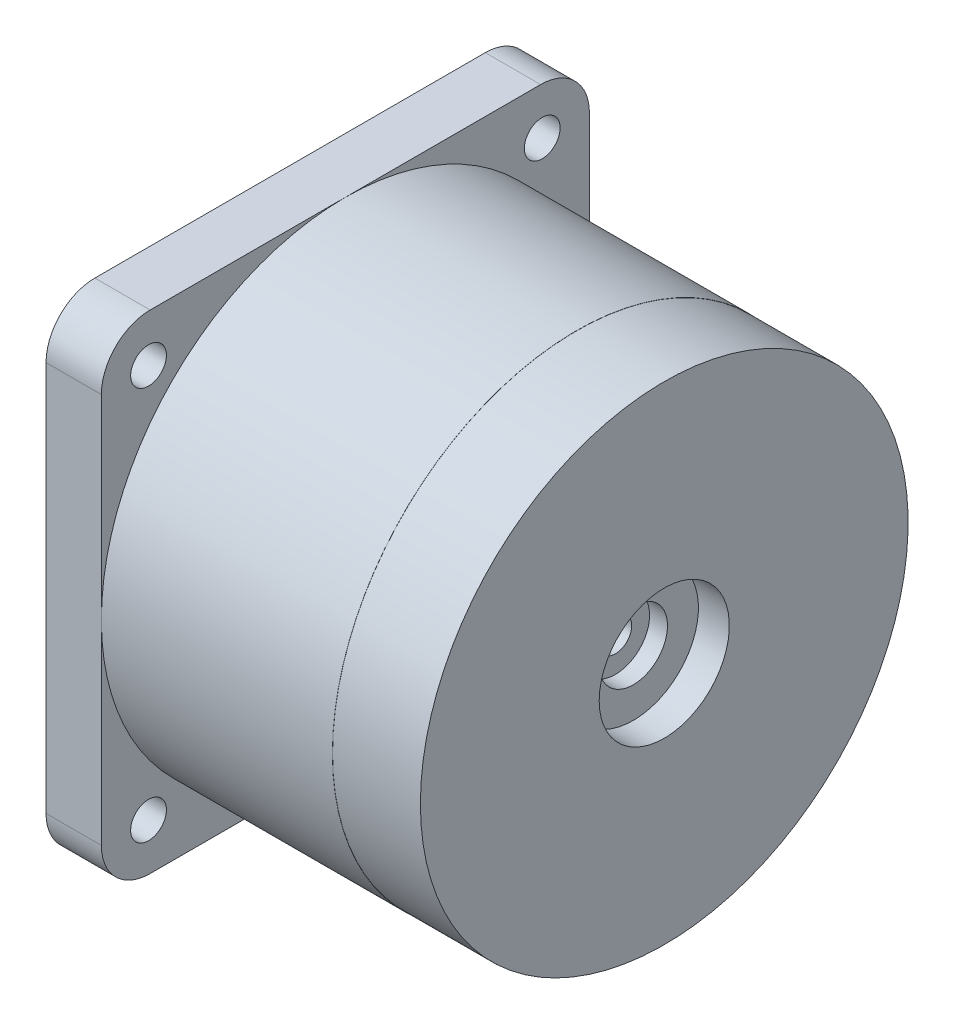
ISO-10303-21;
HEADER;
FILE_DESCRIPTION(('STEP AP214'),'2;1');
FILE_NAME('part.step','',(''),(''),'','','');
FILE_SCHEMA(('AUTOMOTIVE_DESIGN { 1 0 10303 214 1 1 1 1 }'));
ENDSEC;
DATA;
#1=APPLICATION_CONTEXT('core data for automotive mechanical design processes');
#2=APPLICATION_PROTOCOL_DEFINITION('international standard','automotive_design',2000,#1);
#3=PRODUCT_CONTEXT('',#1,'mechanical');
#4=PRODUCT('Part','Part','',(#3));
#5=PRODUCT_RELATED_PRODUCT_CATEGORY('part','',(#4));
#6=PRODUCT_DEFINITION_FORMATION('','',#4);
#7=PRODUCT_DEFINITION_CONTEXT('part definition',#1,'design');
#8=PRODUCT_DEFINITION('design','',#6,#7);
#9=PRODUCT_DEFINITION_SHAPE('','',#8);
#10=(LENGTH_UNIT() NAMED_UNIT(*) SI_UNIT(.MILLI.,.METRE.));
#11=(NAMED_UNIT(*) PLANE_ANGLE_UNIT() SI_UNIT($,.RADIAN.));
#12=(NAMED_UNIT(*) SI_UNIT($,.STERADIAN.) SOLID_ANGLE_UNIT());
#13=UNCERTAINTY_MEASURE_WITH_UNIT(LENGTH_MEASURE(1.E-05),#10,'distance_accuracy_value','');
#14=(GEOMETRIC_REPRESENTATION_CONTEXT(3) GLOBAL_UNCERTAINTY_ASSIGNED_CONTEXT((#13)) GLOBAL_UNIT_ASSIGNED_CONTEXT((#10,
#11,#12)) REPRESENTATION_CONTEXT('',''));
#15=CARTESIAN_POINT('',(0.,0.,0.));
#16=DIRECTION('',(0.,0.,1.));
#17=DIRECTION('',(1.,0.,0.));
#18=AXIS2_PLACEMENT_3D('',#15,#16,#17);
#19=CARTESIAN_POINT('',(0.,0.,0.));
#20=DIRECTION('',(-1.,0.,0.));
#21=DIRECTION('',(0.,0.,1.));
#22=AXIS2_PLACEMENT_3D('',#19,#20,#21);
#23=PLANE('',#22);
#24=CARTESIAN_POINT('',(0.,0.,0.));
#25=DIRECTION('',(-1.,0.,0.));
#26=DIRECTION('',(0.,0.,1.));
#27=AXIS2_PLACEMENT_3D('',#24,#25,#26);
#28=CIRCLE('',#27,14.99);
#29=CARTESIAN_POINT('',(0.,0.,14.99));
#30=VERTEX_POINT('',#29);
#31=EDGE_CURVE('E168',#30,#30,#28,.T.);
#32=ORIENTED_EDGE('',*,*,#31,.F.);
#33=EDGE_LOOP('',(#32));
#34=FACE_BOUND('',#33,.T.);
#35=CARTESIAN_POINT('',(0.,0.,0.));
#36=DIRECTION('',(-1.,0.,0.));
#37=DIRECTION('',(0.,0.,1.));
#38=AXIS2_PLACEMENT_3D('',#35,#36,#37);
#39=CIRCLE('',#38,4.);
#40=CARTESIAN_POINT('',(0.,0.,4.));
#41=VERTEX_POINT('',#40);
#42=EDGE_CURVE('E260',#41,#41,#39,.T.);
#43=ORIENTED_EDGE('',*,*,#42,.T.);
#44=EDGE_LOOP('',(#43));
#45=FACE_BOUND('',#44,.T.);
#46=ADVANCED_FACE('F31',(#34,#45),#23,.F.);
#47=CARTESIAN_POINT('',(-21.4,0.,0.));
#48=DIRECTION('',(-1.,0.,0.));
#49=DIRECTION('',(0.,0.,1.));
#50=AXIS2_PLACEMENT_3D('',#47,#48,#49);
#51=PLANE('',#50);
#52=CARTESIAN_POINT('',(-21.4,0.,0.));
#53=DIRECTION('',(-1.,0.,0.));
#54=DIRECTION('',(0.,0.,1.));
#55=AXIS2_PLACEMENT_3D('',#52,#53,#54);
#56=CIRCLE('',#55,13.5);
#57=CARTESIAN_POINT('',(-21.4,0.,13.5));
#58=VERTEX_POINT('',#57);
#59=EDGE_CURVE('E248',#58,#58,#56,.T.);
#60=ORIENTED_EDGE('',*,*,#59,.T.);
#61=EDGE_LOOP('',(#60));
#62=FACE_BOUND('',#61,.T.);
#63=CARTESIAN_POINT('',(-21.4,-4.9,0.));
#64=DIRECTION('',(-1.,0.,0.));
#65=DIRECTION('',(0.,0.,1.));
#66=AXIS2_PLACEMENT_3D('',#63,#64,#65);
#67=CIRCLE('',#66,5.);
#68=CARTESIAN_POINT('',(-21.4,-4.9,5.));
#69=VERTEX_POINT('',#68);
#70=EDGE_CURVE('E257',#69,#69,#67,.T.);
#71=ORIENTED_EDGE('',*,*,#70,.F.);
#72=EDGE_LOOP('',(#71));
#73=FACE_BOUND('',#72,.T.);
#74=ADVANCED_FACE('F291',(#62,#73),#51,.T.);
#75=CARTESIAN_POINT('',(0.,0.,0.));
#76=DIRECTION('',(-1.,0.,0.));
#77=DIRECTION('',(0.,0.,1.));
#78=AXIS2_PLACEMENT_3D('',#75,#76,#77);
#79=CYLINDRICAL_SURFACE('',#78,14.99);
#80=CARTESIAN_POINT('',(-5.4,0.,0.));
#81=DIRECTION('',(-1.,0.,0.));
#82=DIRECTION('',(0.,0.,1.));
#83=AXIS2_PLACEMENT_3D('',#80,#81,#82);
#84=CIRCLE('',#83,14.99);
#85=CARTESIAN_POINT('',(-5.4,0.,14.99));
#86=VERTEX_POINT('',#85);
#87=EDGE_CURVE('E165',#86,#86,#84,.T.);
#88=ORIENTED_EDGE('',*,*,#87,.F.);
#89=EDGE_LOOP('',(#88));
#90=FACE_BOUND('',#89,.T.);
#91=ORIENTED_EDGE('',*,*,#31,.T.);
#92=EDGE_LOOP('',(#91));
#93=FACE_BOUND('',#92,.T.);
#94=ADVANCED_FACE('F296',(#90,#93),#79,.T.);
#95=CARTESIAN_POINT('',(-5.4,14.99,0.));
#96=DIRECTION('',(-1.,0.,0.));
#97=DIRECTION('',(0.,0.,1.));
#98=AXIS2_PLACEMENT_3D('',#95,#96,#97);
#99=PLANE('',#98);
#100=CARTESIAN_POINT('',(-5.4,0.,0.));
#101=DIRECTION('',(-1.,0.,0.));
#102=DIRECTION('',(0.,0.,1.));
#103=AXIS2_PLACEMENT_3D('',#100,#101,#102);
#104=CIRCLE('',#103,15.);
#105=CARTESIAN_POINT('',(-5.4,0.,15.));
#106=VERTEX_POINT('',#105);
#107=EDGE_CURVE('E136',#106,#106,#104,.T.);
#108=ORIENTED_EDGE('',*,*,#107,.F.);
#109=EDGE_LOOP('',(#108));
#110=FACE_BOUND('',#109,.T.);
#111=ORIENTED_EDGE('',*,*,#87,.T.);
#112=EDGE_LOOP('',(#111));
#113=FACE_BOUND('',#112,.T.);
#114=ADVANCED_FACE('F372',(#110,#113),#99,.F.);
#115=CARTESIAN_POINT('',(0.,0.,0.));
#116=DIRECTION('',(-1.,0.,0.));
#117=DIRECTION('',(0.,0.,1.));
#118=AXIS2_PLACEMENT_3D('',#115,#116,#117);
#119=CYLINDRICAL_SURFACE('',#118,15.);
#120=CARTESIAN_POINT('',(-19.6,0.,0.));
#121=DIRECTION('',(-1.,0.,0.));
#122=DIRECTION('',(0.,0.,1.));
#123=AXIS2_PLACEMENT_3D('',#120,#121,#122);
#124=CIRCLE('',#123,15.);
#125=CARTESIAN_POINT('',(-19.6,0.,15.));
#126=VERTEX_POINT('',#125);
#127=CARTESIAN_POINT('',(-19.6,15.,0.));
#128=VERTEX_POINT('',#127);
#129=EDGE_CURVE('E125',#126,#128,#124,.T.);
#130=ORIENTED_EDGE('',*,*,#129,.F.);
#131=CARTESIAN_POINT('',(-19.6,-15.,0.));
#132=VERTEX_POINT('',#131);
#133=EDGE_CURVE('E129',#132,#126,#124,.T.);
#134=ORIENTED_EDGE('',*,*,#133,.F.);
#135=CARTESIAN_POINT('',(-19.6,0.,-15.));
#136=VERTEX_POINT('',#135);
#137=EDGE_CURVE('E142',#136,#132,#124,.T.);
#138=ORIENTED_EDGE('',*,*,#137,.F.);
#139=EDGE_CURVE('E132',#128,#136,#124,.T.);
#140=ORIENTED_EDGE('',*,*,#139,.F.);
#141=EDGE_LOOP('',(#130,#134,#138,#140));
#142=FACE_BOUND('',#141,.T.);
#143=ORIENTED_EDGE('',*,*,#107,.T.);
#144=EDGE_LOOP('',(#143));
#145=FACE_BOUND('',#144,.T.);
#146=ADVANCED_FACE('F126',(#142,#145),#119,.T.);
#147=CARTESIAN_POINT('',(-19.6,-15.,-15.));
#148=DIRECTION('',(-1.,0.,0.));
#149=DIRECTION('',(0.,0.,1.));
#150=AXIS2_PLACEMENT_3D('',#147,#148,#149);
#151=PLANE('',#150);
#152=CARTESIAN_POINT('',(-19.6,12.1,12.1));
#153=DIRECTION('',(-1.,0.,0.));
#154=DIRECTION('',(0.,0.,1.));
#155=AXIS2_PLACEMENT_3D('',#152,#153,#154);
#156=CIRCLE('',#155,1.1);
#157=CARTESIAN_POINT('',(-19.6,12.1,13.2));
#158=VERTEX_POINT('',#157);
#159=EDGE_CURVE('E233',#158,#158,#156,.T.);
#160=ORIENTED_EDGE('',*,*,#159,.T.);
#161=EDGE_LOOP('',(#160));
#162=FACE_BOUND('',#161,.T.);
#163=DIRECTION('',(0.,0.,-1.));
#164=VECTOR('',#163,1.);
#165=CARTESIAN_POINT('',(-19.6,15.,-15.));
#166=LINE('',#165,#164);
#167=CARTESIAN_POINT('',(-19.6,15.,12.));
#168=VERTEX_POINT('',#167);
#169=EDGE_CURVE('E150',#168,#128,#166,.T.);
#170=ORIENTED_EDGE('',*,*,#169,.F.);
#171=CARTESIAN_POINT('',(-19.6,12.,12.));
#172=DIRECTION('',(-1.,0.,0.));
#173=DIRECTION('',(0.,0.,1.));
#174=AXIS2_PLACEMENT_3D('',#171,#172,#173);
#175=CIRCLE('',#174,3.);
#176=CARTESIAN_POINT('',(-19.6,12.,15.));
#177=VERTEX_POINT('',#176);
#178=EDGE_CURVE('E145',#168,#177,#175,.F.);
#179=ORIENTED_EDGE('',*,*,#178,.T.);
#180=DIRECTION('',(0.,1.,0.));
#181=VECTOR('',#180,1.);
#182=CARTESIAN_POINT('',(-19.6,15.,15.));
#183=LINE('',#182,#181);
#184=EDGE_CURVE('E112',#126,#177,#183,.T.);
#185=ORIENTED_EDGE('',*,*,#184,.F.);
#186=ORIENTED_EDGE('',*,*,#129,.T.);
#187=EDGE_LOOP('',(#170,#179,#185,#186));
#188=FACE_BOUND('',#187,.T.);
#189=ADVANCED_FACE('F144',(#162,#188),#151,.F.);
#190=CARTESIAN_POINT('',(-19.6,12.1,-12.1));
#191=DIRECTION('',(-1.,0.,0.));
#192=DIRECTION('',(0.,0.,1.));
#193=AXIS2_PLACEMENT_3D('',#190,#191,#192);
#194=CIRCLE('',#193,1.1);
#195=CARTESIAN_POINT('',(-19.6,12.1,-11.));
#196=VERTEX_POINT('',#195);
#197=EDGE_CURVE('E227',#196,#196,#194,.T.);
#198=ORIENTED_EDGE('',*,*,#197,.T.);
#199=EDGE_LOOP('',(#198));
#200=FACE_BOUND('',#199,.T.);
#201=DIRECTION('',(0.,-1.,0.));
#202=VECTOR('',#201,1.);
#203=CARTESIAN_POINT('',(-19.6,15.,-15.));
#204=LINE('',#203,#202);
#205=CARTESIAN_POINT('',(-19.6,12.,-15.));
#206=VERTEX_POINT('',#205);
#207=EDGE_CURVE('E217',#206,#136,#204,.T.);
#208=ORIENTED_EDGE('',*,*,#207,.F.);
#209=CARTESIAN_POINT('',(-19.6,12.,-12.));
#210=DIRECTION('',(-1.,0.,0.));
#211=DIRECTION('',(0.,0.,1.));
#212=AXIS2_PLACEMENT_3D('',#209,#210,#211);
#213=CIRCLE('',#212,3.);
#214=CARTESIAN_POINT('',(-19.6,15.,-12.));
#215=VERTEX_POINT('',#214);
#216=EDGE_CURVE('E11',#206,#215,#213,.F.);
#217=ORIENTED_EDGE('',*,*,#216,.T.);
#218=EDGE_CURVE('E119',#128,#215,#166,.T.);
#219=ORIENTED_EDGE('',*,*,#218,.F.);
#220=ORIENTED_EDGE('',*,*,#139,.T.);
#221=EDGE_LOOP('',(#208,#217,#219,#220));
#222=FACE_BOUND('',#221,.T.);
#223=ADVANCED_FACE('F216',(#200,#222),#151,.F.);
#224=CARTESIAN_POINT('',(-19.6,-12.1,-12.1));
#225=DIRECTION('',(-1.,0.,0.));
#226=DIRECTION('',(0.,0.,1.));
#227=AXIS2_PLACEMENT_3D('',#224,#225,#226);
#228=CIRCLE('',#227,1.1);
#229=CARTESIAN_POINT('',(-19.6,-12.1,-11.));
#230=VERTEX_POINT('',#229);
#231=EDGE_CURVE('E239',#230,#230,#228,.T.);
#232=ORIENTED_EDGE('',*,*,#231,.T.);
#233=EDGE_LOOP('',(#232));
#234=FACE_BOUND('',#233,.T.);
#235=DIRECTION('',(0.,0.,1.));
#236=VECTOR('',#235,1.);
#237=CARTESIAN_POINT('',(-19.6,-15.,-15.));
#238=LINE('',#237,#236);
#239=CARTESIAN_POINT('',(-19.6,-15.,-12.));
#240=VERTEX_POINT('',#239);
#241=EDGE_CURVE('E146',#240,#132,#238,.T.);
#242=ORIENTED_EDGE('',*,*,#241,.F.);
#243=CARTESIAN_POINT('',(-19.6,-12.,-12.));
#244=DIRECTION('',(-1.,0.,0.));
#245=DIRECTION('',(0.,0.,1.));
#246=AXIS2_PLACEMENT_3D('',#243,#244,#245);
#247=CIRCLE('',#246,3.);
#248=CARTESIAN_POINT('',(-19.6,-12.,-15.));
#249=VERTEX_POINT('',#248);
#250=EDGE_CURVE('E51',#240,#249,#247,.F.);
#251=ORIENTED_EDGE('',*,*,#250,.T.);
#252=EDGE_CURVE('E201',#136,#249,#204,.T.);
#253=ORIENTED_EDGE('',*,*,#252,.F.);
#254=ORIENTED_EDGE('',*,*,#137,.T.);
#255=EDGE_LOOP('',(#242,#251,#253,#254));
#256=FACE_BOUND('',#255,.T.);
#257=ADVANCED_FACE('F213',(#234,#256),#151,.F.);
#258=CARTESIAN_POINT('',(-19.6,-12.1,12.1));
#259=DIRECTION('',(-1.,0.,0.));
#260=DIRECTION('',(0.,0.,1.));
#261=AXIS2_PLACEMENT_3D('',#258,#259,#260);
#262=CIRCLE('',#261,1.1);
#263=CARTESIAN_POINT('',(-19.6,-12.1,13.2));
#264=VERTEX_POINT('',#263);
#265=EDGE_CURVE('E245',#264,#264,#262,.T.);
#266=ORIENTED_EDGE('',*,*,#265,.T.);
#267=EDGE_LOOP('',(#266));
#268=FACE_BOUND('',#267,.T.);
#269=CARTESIAN_POINT('',(-19.6,-12.,15.));
#270=VERTEX_POINT('',#269);
#271=EDGE_CURVE('E108',#270,#126,#183,.T.);
#272=ORIENTED_EDGE('',*,*,#271,.F.);
#273=CARTESIAN_POINT('',(-19.6,-12.,12.));
#274=DIRECTION('',(-1.,0.,0.));
#275=DIRECTION('',(0.,0.,1.));
#276=AXIS2_PLACEMENT_3D('',#273,#274,#275);
#277=CIRCLE('',#276,3.);
#278=CARTESIAN_POINT('',(-19.6,-15.,12.));
#279=VERTEX_POINT('',#278);
#280=EDGE_CURVE('E188',#270,#279,#277,.F.);
#281=ORIENTED_EDGE('',*,*,#280,.T.);
#282=EDGE_CURVE('E141',#132,#279,#238,.T.);
#283=ORIENTED_EDGE('',*,*,#282,.F.);
#284=ORIENTED_EDGE('',*,*,#133,.T.);
#285=EDGE_LOOP('',(#272,#281,#283,#284));
#286=FACE_BOUND('',#285,.T.);
#287=ADVANCED_FACE('F139',(#268,#286),#151,.F.);
#288=CARTESIAN_POINT('',(-23.,-15.,-15.));
#289=DIRECTION('',(-1.,0.,0.));
#290=DIRECTION('',(0.,0.,1.));
#291=AXIS2_PLACEMENT_3D('',#288,#289,#290);
#292=PLANE('',#291);
#293=CARTESIAN_POINT('',(-23.,0.,0.));
#294=DIRECTION('',(-1.,0.,0.));
#295=DIRECTION('',(0.,0.,1.));
#296=AXIS2_PLACEMENT_3D('',#293,#294,#295);
#297=CIRCLE('',#296,13.5);
#298=CARTESIAN_POINT('',(-23.,0.,13.5));
#299=VERTEX_POINT('',#298);
#300=EDGE_CURVE('E251',#299,#299,#297,.T.);
#301=ORIENTED_EDGE('',*,*,#300,.F.);
#302=EDGE_LOOP('',(#301));
#303=FACE_BOUND('',#302,.T.);
#304=CARTESIAN_POINT('',(-23.,-12.1,-12.1));
#305=DIRECTION('',(-1.,0.,0.));
#306=DIRECTION('',(0.,0.,1.));
#307=AXIS2_PLACEMENT_3D('',#304,#305,#306);
#308=CIRCLE('',#307,1.1);
#309=CARTESIAN_POINT('',(-23.,-12.1,-11.));
#310=VERTEX_POINT('',#309);
#311=EDGE_CURVE('E236',#310,#310,#308,.T.);
#312=ORIENTED_EDGE('',*,*,#311,.F.);
#313=EDGE_LOOP('',(#312));
#314=FACE_BOUND('',#313,.T.);
#315=CARTESIAN_POINT('',(-23.,12.1,-12.1));
#316=DIRECTION('',(-1.,0.,0.));
#317=DIRECTION('',(0.,0.,1.));
#318=AXIS2_PLACEMENT_3D('',#315,#316,#317);
#319=CIRCLE('',#318,1.1);
#320=CARTESIAN_POINT('',(-23.,12.1,-11.));
#321=VERTEX_POINT('',#320);
#322=EDGE_CURVE('E223',#321,#321,#319,.T.);
#323=ORIENTED_EDGE('',*,*,#322,.F.);
#324=EDGE_LOOP('',(#323));
#325=FACE_BOUND('',#324,.T.);
#326=DIRECTION('',(0.,1.,0.));
#327=VECTOR('',#326,1.);
#328=CARTESIAN_POINT('',(-23.,15.,15.));
#329=LINE('',#328,#327);
#330=CARTESIAN_POINT('',(-23.,-12.,15.));
#331=VERTEX_POINT('',#330);
#332=CARTESIAN_POINT('',(-23.,12.,15.));
#333=VERTEX_POINT('',#332);
#334=EDGE_CURVE('E158',#331,#333,#329,.T.);
#335=ORIENTED_EDGE('',*,*,#334,.T.);
#336=CARTESIAN_POINT('',(-23.,12.,12.));
#337=DIRECTION('',(-1.,0.,0.));
#338=DIRECTION('',(0.,0.,1.));
#339=AXIS2_PLACEMENT_3D('',#336,#337,#338);
#340=CIRCLE('',#339,3.);
#341=CARTESIAN_POINT('',(-23.,15.,12.));
#342=VERTEX_POINT('',#341);
#343=EDGE_CURVE('E186',#333,#342,#340,.T.);
#344=ORIENTED_EDGE('',*,*,#343,.T.);
#345=DIRECTION('',(0.,0.,-1.));
#346=VECTOR('',#345,1.);
#347=CARTESIAN_POINT('',(-23.,15.,-15.));
#348=LINE('',#347,#346);
#349=CARTESIAN_POINT('',(-23.,15.,-12.));
#350=VERTEX_POINT('',#349);
#351=EDGE_CURVE('E143',#342,#350,#348,.T.);
#352=ORIENTED_EDGE('',*,*,#351,.T.);
#353=CARTESIAN_POINT('',(-23.,12.,-12.));
#354=DIRECTION('',(-1.,0.,0.));
#355=DIRECTION('',(0.,0.,1.));
#356=AXIS2_PLACEMENT_3D('',#353,#354,#355);
#357=CIRCLE('',#356,3.);
#358=CARTESIAN_POINT('',(-23.,12.,-15.));
#359=VERTEX_POINT('',#358);
#360=EDGE_CURVE('E180',#350,#359,#357,.T.);
#361=ORIENTED_EDGE('',*,*,#360,.T.);
#362=DIRECTION('',(0.,-1.,0.));
#363=VECTOR('',#362,1.);
#364=CARTESIAN_POINT('',(-23.,15.,-15.));
#365=LINE('',#364,#363);
#366=CARTESIAN_POINT('',(-23.,-12.,-15.));
#367=VERTEX_POINT('',#366);
#368=EDGE_CURVE('E152',#359,#367,#365,.T.);
#369=ORIENTED_EDGE('',*,*,#368,.T.);
#370=CARTESIAN_POINT('',(-23.,-12.,-12.));
#371=DIRECTION('',(-1.,0.,0.));
#372=DIRECTION('',(0.,0.,1.));
#373=AXIS2_PLACEMENT_3D('',#370,#371,#372);
#374=CIRCLE('',#373,3.);
#375=CARTESIAN_POINT('',(-23.,-15.,-12.));
#376=VERTEX_POINT('',#375);
#377=EDGE_CURVE('E182',#367,#376,#374,.T.);
#378=ORIENTED_EDGE('',*,*,#377,.T.);
#379=DIRECTION('',(0.,0.,1.));
#380=VECTOR('',#379,1.);
#381=CARTESIAN_POINT('',(-23.,-15.,-15.));
#382=LINE('',#381,#380);
#383=CARTESIAN_POINT('',(-23.,-15.,12.));
#384=VERTEX_POINT('',#383);
#385=EDGE_CURVE('E155',#376,#384,#382,.T.);
#386=ORIENTED_EDGE('',*,*,#385,.T.);
#387=CARTESIAN_POINT('',(-23.,-12.,12.));
#388=DIRECTION('',(-1.,0.,0.));
#389=DIRECTION('',(0.,0.,1.));
#390=AXIS2_PLACEMENT_3D('',#387,#388,#389);
#391=CIRCLE('',#390,3.);
#392=EDGE_CURVE('E184',#384,#331,#391,.T.);
#393=ORIENTED_EDGE('',*,*,#392,.T.);
#394=EDGE_LOOP('',(#335,#344,#352,#361,#369,#378,#386,#393));
#395=FACE_BOUND('',#394,.T.);
#396=CARTESIAN_POINT('',(-23.,12.1,12.1));
#397=DIRECTION('',(-1.,0.,0.));
#398=DIRECTION('',(0.,0.,1.));
#399=AXIS2_PLACEMENT_3D('',#396,#397,#398);
#400=CIRCLE('',#399,1.1);
#401=CARTESIAN_POINT('',(-23.,12.1,13.2));
#402=VERTEX_POINT('',#401);
#403=EDGE_CURVE('E230',#402,#402,#400,.T.);
#404=ORIENTED_EDGE('',*,*,#403,.F.);
#405=EDGE_LOOP('',(#404));
#406=FACE_BOUND('',#405,.T.);
#407=CARTESIAN_POINT('',(-23.,-12.1,12.1));
#408=DIRECTION('',(-1.,0.,0.));
#409=DIRECTION('',(0.,0.,1.));
#410=AXIS2_PLACEMENT_3D('',#407,#408,#409);
#411=CIRCLE('',#410,1.1);
#412=CARTESIAN_POINT('',(-23.,-12.1,13.2));
#413=VERTEX_POINT('',#412);
#414=EDGE_CURVE('E242',#413,#413,#411,.T.);
#415=ORIENTED_EDGE('',*,*,#414,.F.);
#416=EDGE_LOOP('',(#415));
#417=FACE_BOUND('',#416,.T.);
#418=ADVANCED_FACE('F205',(#303,#314,#325,#395,#406,#417),#292,.T.);
#419=CARTESIAN_POINT('',(-23.,15.,-15.));
#420=DIRECTION('',(0.,0.,1.));
#421=DIRECTION('',(0.,-1.,0.));
#422=AXIS2_PLACEMENT_3D('',#419,#420,#421);
#423=PLANE('',#422);
#424=ORIENTED_EDGE('',*,*,#252,.T.);
#425=DIRECTION('',(1.,0.,0.));
#426=VECTOR('',#425,1.);
#427=CARTESIAN_POINT('',(-23.,-12.,-15.));
#428=LINE('',#427,#426);
#429=EDGE_CURVE('E38',#249,#367,#428,.F.);
#430=ORIENTED_EDGE('',*,*,#429,.T.);
#431=ORIENTED_EDGE('',*,*,#368,.F.);
#432=DIRECTION('',(1.,0.,0.));
#433=VECTOR('',#432,1.);
#434=CARTESIAN_POINT('',(-23.,12.,-15.));
#435=LINE('',#434,#433);
#436=EDGE_CURVE('E196',#359,#206,#435,.T.);
#437=ORIENTED_EDGE('',*,*,#436,.T.);
#438=ORIENTED_EDGE('',*,*,#207,.T.);
#439=EDGE_LOOP('',(#424,#430,#431,#437,#438));
#440=FACE_BOUND('',#439,.T.);
#441=ADVANCED_FACE('F200',(#440),#423,.F.);
#442=CARTESIAN_POINT('',(-23.,-15.,-15.));
#443=DIRECTION('',(0.,1.,0.));
#444=DIRECTION('',(0.,0.,1.));
#445=AXIS2_PLACEMENT_3D('',#442,#443,#444);
#446=PLANE('',#445);
#447=ORIENTED_EDGE('',*,*,#282,.T.);
#448=DIRECTION('',(1.,0.,0.));
#449=VECTOR('',#448,1.);
#450=CARTESIAN_POINT('',(-23.,-15.,12.));
#451=LINE('',#450,#449);
#452=EDGE_CURVE('E193',#279,#384,#451,.F.);
#453=ORIENTED_EDGE('',*,*,#452,.T.);
#454=ORIENTED_EDGE('',*,*,#385,.F.);
#455=DIRECTION('',(1.,0.,0.));
#456=VECTOR('',#455,1.);
#457=CARTESIAN_POINT('',(-23.,-15.,-12.));
#458=LINE('',#457,#456);
#459=EDGE_CURVE('E190',#376,#240,#458,.T.);
#460=ORIENTED_EDGE('',*,*,#459,.T.);
#461=ORIENTED_EDGE('',*,*,#241,.T.);
#462=EDGE_LOOP('',(#447,#453,#454,#460,#461));
#463=FACE_BOUND('',#462,.T.);
#464=ADVANCED_FACE('F212',(#463),#446,.F.);
#465=CARTESIAN_POINT('',(-23.,15.,15.));
#466=DIRECTION('',(0.,0.,-1.));
#467=DIRECTION('',(0.,1.,0.));
#468=AXIS2_PLACEMENT_3D('',#465,#466,#467);
#469=PLANE('',#468);
#470=ORIENTED_EDGE('',*,*,#184,.T.);
#471=DIRECTION('',(1.,0.,0.));
#472=VECTOR('',#471,1.);
#473=CARTESIAN_POINT('',(-23.,12.,15.));
#474=LINE('',#473,#472);
#475=EDGE_CURVE('E178',#177,#333,#474,.F.);
#476=ORIENTED_EDGE('',*,*,#475,.T.);
#477=ORIENTED_EDGE('',*,*,#334,.F.);
#478=DIRECTION('',(1.,0.,0.));
#479=VECTOR('',#478,1.);
#480=CARTESIAN_POINT('',(-23.,-12.,15.));
#481=LINE('',#480,#479);
#482=EDGE_CURVE('E116',#331,#270,#481,.T.);
#483=ORIENTED_EDGE('',*,*,#482,.T.);
#484=ORIENTED_EDGE('',*,*,#271,.T.);
#485=EDGE_LOOP('',(#470,#476,#477,#483,#484));
#486=FACE_BOUND('',#485,.T.);
#487=ADVANCED_FACE('F110',(#486),#469,.F.);
#488=CARTESIAN_POINT('',(-23.,15.,-15.));
#489=DIRECTION('',(0.,-1.,0.));
#490=DIRECTION('',(0.,0.,-1.));
#491=AXIS2_PLACEMENT_3D('',#488,#489,#490);
#492=PLANE('',#491);
#493=ORIENTED_EDGE('',*,*,#351,.F.);
#494=DIRECTION('',(1.,0.,0.));
#495=VECTOR('',#494,1.);
#496=CARTESIAN_POINT('',(-23.,15.,12.));
#497=LINE('',#496,#495);
#498=EDGE_CURVE('E173',#342,#168,#497,.T.);
#499=ORIENTED_EDGE('',*,*,#498,.T.);
#500=ORIENTED_EDGE('',*,*,#169,.T.);
#501=ORIENTED_EDGE('',*,*,#218,.T.);
#502=DIRECTION('',(1.,0.,0.));
#503=VECTOR('',#502,1.);
#504=CARTESIAN_POINT('',(-23.,15.,-12.));
#505=LINE('',#504,#503);
#506=EDGE_CURVE('E171',#215,#350,#505,.F.);
#507=ORIENTED_EDGE('',*,*,#506,.T.);
#508=EDGE_LOOP('',(#493,#499,#500,#501,#507));
#509=FACE_BOUND('',#508,.T.);
#510=ADVANCED_FACE('F221',(#509),#492,.F.);
#511=CARTESIAN_POINT('',(-23.,12.1,-12.1));
#512=DIRECTION('',(1.,0.,0.));
#513=DIRECTION('',(0.,0.,-1.));
#514=AXIS2_PLACEMENT_3D('',#511,#512,#513);
#515=CYLINDRICAL_SURFACE('',#514,1.1);
#516=ORIENTED_EDGE('',*,*,#322,.T.);
#517=EDGE_LOOP('',(#516));
#518=FACE_BOUND('',#517,.T.);
#519=ORIENTED_EDGE('',*,*,#197,.F.);
#520=EDGE_LOOP('',(#519));
#521=FACE_BOUND('',#520,.T.);
#522=ADVANCED_FACE('F351',(#518,#521),#515,.F.);
#523=CARTESIAN_POINT('',(-23.,12.1,12.1));
#524=DIRECTION('',(1.,0.,0.));
#525=DIRECTION('',(0.,0.,-1.));
#526=AXIS2_PLACEMENT_3D('',#523,#524,#525);
#527=CYLINDRICAL_SURFACE('',#526,1.1);
#528=ORIENTED_EDGE('',*,*,#403,.T.);
#529=EDGE_LOOP('',(#528));
#530=FACE_BOUND('',#529,.T.);
#531=ORIENTED_EDGE('',*,*,#159,.F.);
#532=EDGE_LOOP('',(#531));
#533=FACE_BOUND('',#532,.T.);
#534=ADVANCED_FACE('F347',(#530,#533),#527,.F.);
#535=CARTESIAN_POINT('',(-23.,-12.1,-12.1));
#536=DIRECTION('',(1.,0.,0.));
#537=DIRECTION('',(0.,0.,-1.));
#538=AXIS2_PLACEMENT_3D('',#535,#536,#537);
#539=CYLINDRICAL_SURFACE('',#538,1.1);
#540=ORIENTED_EDGE('',*,*,#311,.T.);
#541=EDGE_LOOP('',(#540));
#542=FACE_BOUND('',#541,.T.);
#543=ORIENTED_EDGE('',*,*,#231,.F.);
#544=EDGE_LOOP('',(#543));
#545=FACE_BOUND('',#544,.T.);
#546=ADVANCED_FACE('F343',(#542,#545),#539,.F.);
#547=CARTESIAN_POINT('',(-23.,-12.1,12.1));
#548=DIRECTION('',(1.,0.,0.));
#549=DIRECTION('',(0.,0.,-1.));
#550=AXIS2_PLACEMENT_3D('',#547,#548,#549);
#551=CYLINDRICAL_SURFACE('',#550,1.1);
#552=ORIENTED_EDGE('',*,*,#414,.T.);
#553=EDGE_LOOP('',(#552));
#554=FACE_BOUND('',#553,.T.);
#555=ORIENTED_EDGE('',*,*,#265,.F.);
#556=EDGE_LOOP('',(#555));
#557=FACE_BOUND('',#556,.T.);
#558=ADVANCED_FACE('F339',(#554,#557),#551,.F.);
#559=CARTESIAN_POINT('',(-21.4,0.,0.));
#560=DIRECTION('',(-1.,0.,0.));
#561=DIRECTION('',(0.,0.,1.));
#562=AXIS2_PLACEMENT_3D('',#559,#560,#561);
#563=CYLINDRICAL_SURFACE('',#562,13.5);
#564=ORIENTED_EDGE('',*,*,#59,.F.);
#565=EDGE_LOOP('',(#564));
#566=FACE_BOUND('',#565,.T.);
#567=ORIENTED_EDGE('',*,*,#300,.T.);
#568=EDGE_LOOP('',(#567));
#569=FACE_BOUND('',#568,.T.);
#570=ADVANCED_FACE('F334',(#566,#569),#563,.F.);
#571=CARTESIAN_POINT('',(-23.,12.,12.));
#572=DIRECTION('',(1.,0.,0.));
#573=DIRECTION('',(0.,0.,-1.));
#574=AXIS2_PLACEMENT_3D('',#571,#572,#573);
#575=CYLINDRICAL_SURFACE('',#574,3.);
#576=ORIENTED_EDGE('',*,*,#343,.F.);
#577=ORIENTED_EDGE('',*,*,#475,.F.);
#578=ORIENTED_EDGE('',*,*,#178,.F.);
#579=ORIENTED_EDGE('',*,*,#498,.F.);
#580=EDGE_LOOP('',(#576,#577,#578,#579));
#581=FACE_BOUND('',#580,.T.);
#582=ADVANCED_FACE('F331',(#581),#575,.T.);
#583=CARTESIAN_POINT('',(-23.,-12.,12.));
#584=DIRECTION('',(1.,0.,0.));
#585=DIRECTION('',(0.,0.,-1.));
#586=AXIS2_PLACEMENT_3D('',#583,#584,#585);
#587=CYLINDRICAL_SURFACE('',#586,3.);
#588=ORIENTED_EDGE('',*,*,#392,.F.);
#589=ORIENTED_EDGE('',*,*,#452,.F.);
#590=ORIENTED_EDGE('',*,*,#280,.F.);
#591=ORIENTED_EDGE('',*,*,#482,.F.);
#592=EDGE_LOOP('',(#588,#589,#590,#591));
#593=FACE_BOUND('',#592,.T.);
#594=ADVANCED_FACE('F328',(#593),#587,.T.);
#595=CARTESIAN_POINT('',(-23.,-12.,-12.));
#596=DIRECTION('',(1.,0.,0.));
#597=DIRECTION('',(0.,0.,-1.));
#598=AXIS2_PLACEMENT_3D('',#595,#596,#597);
#599=CYLINDRICAL_SURFACE('',#598,3.);
#600=ORIENTED_EDGE('',*,*,#377,.F.);
#601=ORIENTED_EDGE('',*,*,#429,.F.);
#602=ORIENTED_EDGE('',*,*,#250,.F.);
#603=ORIENTED_EDGE('',*,*,#459,.F.);
#604=EDGE_LOOP('',(#600,#601,#602,#603));
#605=FACE_BOUND('',#604,.T.);
#606=ADVANCED_FACE('F210',(#605),#599,.T.);
#607=CARTESIAN_POINT('',(-23.,12.,-12.));
#608=DIRECTION('',(1.,0.,0.));
#609=DIRECTION('',(0.,0.,-1.));
#610=AXIS2_PLACEMENT_3D('',#607,#608,#609);
#611=CYLINDRICAL_SURFACE('',#610,3.);
#612=ORIENTED_EDGE('',*,*,#360,.F.);
#613=ORIENTED_EDGE('',*,*,#506,.F.);
#614=ORIENTED_EDGE('',*,*,#216,.F.);
#615=ORIENTED_EDGE('',*,*,#436,.F.);
#616=EDGE_LOOP('',(#612,#613,#614,#615));
#617=FACE_BOUND('',#616,.T.);
#618=ADVANCED_FACE('F222',(#617),#611,.T.);
#619=CARTESIAN_POINT('',(-28.95,-4.9,0.));
#620=DIRECTION('',(1.,0.,0.));
#621=DIRECTION('',(0.,0.,-1.));
#622=AXIS2_PLACEMENT_3D('',#619,#620,#621);
#623=CYLINDRICAL_SURFACE('',#622,5.);
#624=CARTESIAN_POINT('',(-28.95,-4.9,0.));
#625=DIRECTION('',(-1.,0.,0.));
#626=DIRECTION('',(0.,0.,1.));
#627=AXIS2_PLACEMENT_3D('',#624,#625,#626);
#628=CIRCLE('',#627,5.);
#629=CARTESIAN_POINT('',(-28.95,-4.9,5.));
#630=VERTEX_POINT('',#629);
#631=EDGE_CURVE('E254',#630,#630,#628,.T.);
#632=ORIENTED_EDGE('',*,*,#631,.F.);
#633=EDGE_LOOP('',(#632));
#634=FACE_BOUND('',#633,.T.);
#635=ORIENTED_EDGE('',*,*,#70,.T.);
#636=EDGE_LOOP('',(#635));
#637=FACE_BOUND('',#636,.T.);
#638=ADVANCED_FACE('F316',(#634,#637),#623,.T.);
#639=CARTESIAN_POINT('',(-28.95,-4.9,0.));
#640=DIRECTION('',(-1.,0.,0.));
#641=DIRECTION('',(0.,0.,1.));
#642=AXIS2_PLACEMENT_3D('',#639,#640,#641);
#643=PLANE('',#642);
#644=ORIENTED_EDGE('',*,*,#631,.T.);
#645=EDGE_LOOP('',(#644));
#646=FACE_BOUND('',#645,.T.);
#647=ADVANCED_FACE('F306',(#646),#643,.T.);
#648=CARTESIAN_POINT('',(0.,0.,0.));
#649=DIRECTION('',(-1.,0.,0.));
#650=DIRECTION('',(0.,0.,1.));
#651=AXIS2_PLACEMENT_3D('',#648,#649,#650);
#652=CYLINDRICAL_SURFACE('',#651,4.);
#653=CARTESIAN_POINT('',(-1.9,0.,0.));
#654=DIRECTION('',(-1.,0.,0.));
#655=DIRECTION('',(0.,0.,1.));
#656=AXIS2_PLACEMENT_3D('',#653,#654,#655);
#657=CIRCLE('',#656,4.);
#658=CARTESIAN_POINT('',(-1.9,0.,4.));
#659=VERTEX_POINT('',#658);
#660=EDGE_CURVE('E263',#659,#659,#657,.T.);
#661=ORIENTED_EDGE('',*,*,#660,.T.);
#662=EDGE_LOOP('',(#661));
#663=FACE_BOUND('',#662,.T.);
#664=ORIENTED_EDGE('',*,*,#42,.F.);
#665=EDGE_LOOP('',(#664));
#666=FACE_BOUND('',#665,.T.);
#667=ADVANCED_FACE('F303',(#663,#666),#652,.F.);
#668=CARTESIAN_POINT('',(-1.9,4.,0.));
#669=DIRECTION('',(1.,0.,0.));
#670=DIRECTION('',(0.,0.,-1.));
#671=AXIS2_PLACEMENT_3D('',#668,#669,#670);
#672=PLANE('',#671);
#673=CARTESIAN_POINT('',(-1.9,0.,0.));
#674=DIRECTION('',(-1.,0.,0.));
#675=DIRECTION('',(0.,0.,1.));
#676=AXIS2_PLACEMENT_3D('',#673,#674,#675);
#677=CIRCLE('',#676,2.1);
#678=CARTESIAN_POINT('',(-1.9,0.,2.1));
#679=VERTEX_POINT('',#678);
#680=EDGE_CURVE('E266',#679,#679,#677,.T.);
#681=ORIENTED_EDGE('',*,*,#680,.T.);
#682=EDGE_LOOP('',(#681));
#683=FACE_BOUND('',#682,.T.);
#684=ORIENTED_EDGE('',*,*,#660,.F.);
#685=EDGE_LOOP('',(#684));
#686=FACE_BOUND('',#685,.T.);
#687=ADVANCED_FACE('F305',(#683,#686),#672,.T.);
#688=CARTESIAN_POINT('',(0.,0.,0.));
#689=DIRECTION('',(-1.,0.,0.));
#690=DIRECTION('',(0.,0.,1.));
#691=AXIS2_PLACEMENT_3D('',#688,#689,#690);
#692=CYLINDRICAL_SURFACE('',#691,2.1);
#693=CARTESIAN_POINT('',(-3.,0.,0.));
#694=DIRECTION('',(-1.,0.,0.));
#695=DIRECTION('',(0.,0.,1.));
#696=AXIS2_PLACEMENT_3D('',#693,#694,#695);
#697=CIRCLE('',#696,2.1);
#698=CARTESIAN_POINT('',(-3.,0.,2.1));
#699=VERTEX_POINT('',#698);
#700=EDGE_CURVE('E269',#699,#699,#697,.T.);
#701=ORIENTED_EDGE('',*,*,#700,.T.);
#702=EDGE_LOOP('',(#701));
#703=FACE_BOUND('',#702,.T.);
#704=ORIENTED_EDGE('',*,*,#680,.F.);
#705=EDGE_LOOP('',(#704));
#706=FACE_BOUND('',#705,.T.);
#707=ADVANCED_FACE('F313',(#703,#706),#692,.F.);
#708=CARTESIAN_POINT('',(-3.,2.1,0.));
#709=DIRECTION('',(1.,0.,0.));
#710=DIRECTION('',(0.,0.,-1.));
#711=AXIS2_PLACEMENT_3D('',#708,#709,#710);
#712=PLANE('',#711);
#713=CARTESIAN_POINT('',(-3.,0.,0.));
#714=DIRECTION('',(-1.,0.,0.));
#715=DIRECTION('',(0.,0.,1.));
#716=AXIS2_PLACEMENT_3D('',#713,#714,#715);
#717=CIRCLE('',#716,1.);
#718=CARTESIAN_POINT('',(-3.,0.,1.));
#719=VERTEX_POINT('',#718);
#720=EDGE_CURVE('E272',#719,#719,#717,.T.);
#721=ORIENTED_EDGE('',*,*,#720,.T.);
#722=EDGE_LOOP('',(#721));
#723=FACE_BOUND('',#722,.T.);
#724=ORIENTED_EDGE('',*,*,#700,.F.);
#725=EDGE_LOOP('',(#724));
#726=FACE_BOUND('',#725,.T.);
#727=ADVANCED_FACE('F288',(#723,#726),#712,.T.);
#728=CARTESIAN_POINT('',(0.,0.,0.));
#729=DIRECTION('',(-1.,0.,0.));
#730=DIRECTION('',(0.,0.,1.));
#731=AXIS2_PLACEMENT_3D('',#728,#729,#730);
#732=CYLINDRICAL_SURFACE('',#731,1.);
#733=CARTESIAN_POINT('',(-11.5,0.,0.));
#734=DIRECTION('',(-1.,0.,0.));
#735=DIRECTION('',(0.,0.,1.));
#736=AXIS2_PLACEMENT_3D('',#733,#734,#735);
#737=CIRCLE('',#736,0.999999999999999);
#738=CARTESIAN_POINT('',(-11.5,0.,0.999999999999999));
#739=VERTEX_POINT('',#738);
#740=EDGE_CURVE('E275',#739,#739,#737,.T.);
#741=ORIENTED_EDGE('',*,*,#740,.T.);
#742=EDGE_LOOP('',(#741));
#743=FACE_BOUND('',#742,.T.);
#744=ORIENTED_EDGE('',*,*,#720,.F.);
#745=EDGE_LOOP('',(#744));
#746=FACE_BOUND('',#745,.T.);
#747=ADVANCED_FACE('F279',(#743,#746),#732,.F.);
#748=CARTESIAN_POINT('',(-11.5,0.999999999999999,0.));
#749=DIRECTION('',(1.,0.,0.));
#750=DIRECTION('',(0.,0.,-1.));
#751=AXIS2_PLACEMENT_3D('',#748,#749,#750);
#752=PLANE('',#751);
#753=ORIENTED_EDGE('',*,*,#740,.F.);
#754=EDGE_LOOP('',(#753));
#755=FACE_BOUND('',#754,.T.);
#756=ADVANCED_FACE('F282',(#755),#752,.T.);
#757=CLOSED_SHELL('',(#46,#74,#94,#114,#146,#189,#223,#257,#287,#418,#441,#464,#487,#510,#522,
#534,#546,#558,#570,#582,#594,#606,#618,#638,#647,#667,#687,#707,#727,#747,#756));
#758=MANIFOLD_SOLID_BREP('B2',#757);
#759=ADVANCED_BREP_SHAPE_REPRESENTATION('',(#18,#758),#14);
#760=SHAPE_DEFINITION_REPRESENTATION(#9,#759);
ENDSEC;
END-ISO-10303-21;
